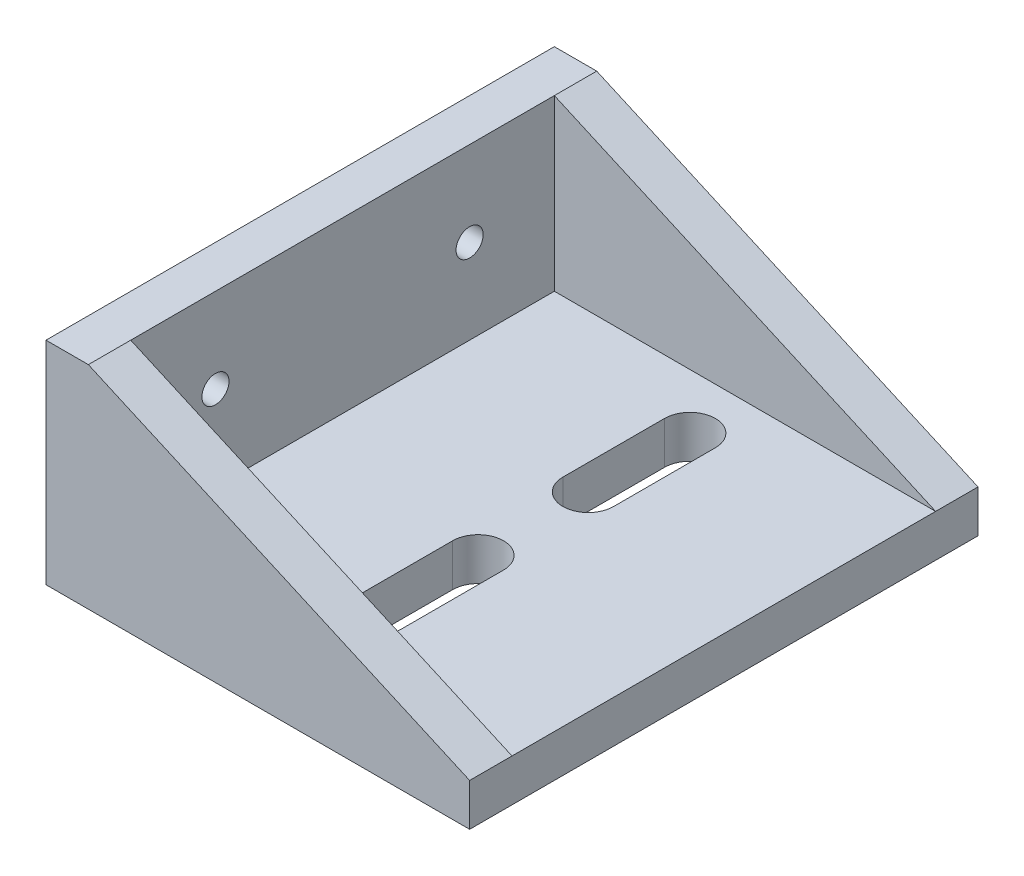
ISO-10303-21;
HEADER;
FILE_DESCRIPTION(('STEP AP214'),'2;1');
FILE_NAME('part.step','',(''),(''),'','','');
FILE_SCHEMA(('AUTOMOTIVE_DESIGN { 1 0 10303 214 1 1 1 1 }'));
ENDSEC;
DATA;
#1=APPLICATION_CONTEXT('core data for automotive mechanical design processes');
#2=APPLICATION_PROTOCOL_DEFINITION('international standard','automotive_design',2000,#1);
#3=PRODUCT_CONTEXT('',#1,'mechanical');
#4=PRODUCT('Part','Part','',(#3));
#5=PRODUCT_RELATED_PRODUCT_CATEGORY('part','',(#4));
#6=PRODUCT_DEFINITION_FORMATION('','',#4);
#7=PRODUCT_DEFINITION_CONTEXT('part definition',#1,'design');
#8=PRODUCT_DEFINITION('design','',#6,#7);
#9=PRODUCT_DEFINITION_SHAPE('','',#8);
#10=(LENGTH_UNIT() NAMED_UNIT(*) SI_UNIT(.MILLI.,.METRE.));
#11=(NAMED_UNIT(*) PLANE_ANGLE_UNIT() SI_UNIT($,.RADIAN.));
#12=(NAMED_UNIT(*) SI_UNIT($,.STERADIAN.) SOLID_ANGLE_UNIT());
#13=UNCERTAINTY_MEASURE_WITH_UNIT(LENGTH_MEASURE(1.E-05),#10,'distance_accuracy_value','');
#14=(GEOMETRIC_REPRESENTATION_CONTEXT(3) GLOBAL_UNCERTAINTY_ASSIGNED_CONTEXT((#13)) GLOBAL_UNIT_ASSIGNED_CONTEXT((#10,
#11,#12)) REPRESENTATION_CONTEXT('',''));
#15=CARTESIAN_POINT('',(0.,0.,0.));
#16=DIRECTION('',(0.,0.,1.));
#17=DIRECTION('',(1.,0.,0.));
#18=AXIS2_PLACEMENT_3D('',#15,#16,#17);
#19=CARTESIAN_POINT('',(-45.,5.,60.));
#20=DIRECTION('',(0.,-1.,0.));
#21=DIRECTION('',(0.,0.,-1.));
#22=AXIS2_PLACEMENT_3D('',#19,#20,#21);
#23=PLANE('',#22);
#24=DIRECTION('',(0.,0.,-1.));
#25=VECTOR('',#24,1.);
#26=CARTESIAN_POINT('',(-19.5,5.,23.5));
#27=LINE('',#26,#25);
#28=CARTESIAN_POINT('',(-19.5,5.,23.5));
#29=VERTEX_POINT('',#28);
#30=CARTESIAN_POINT('',(-19.5,5.,11.5));
#31=VERTEX_POINT('',#30);
#32=EDGE_CURVE('E175',#29,#31,#27,.T.);
#33=ORIENTED_EDGE('',*,*,#32,.F.);
#34=CARTESIAN_POINT('',(-22.5,5.,23.5));
#35=DIRECTION('',(0.,1.,0.));
#36=DIRECTION('',(0.,0.,1.));
#37=AXIS2_PLACEMENT_3D('',#34,#35,#36);
#38=CIRCLE('',#37,3.);
#39=CARTESIAN_POINT('',(-25.5,5.,23.5));
#40=VERTEX_POINT('',#39);
#41=EDGE_CURVE('E48',#40,#29,#38,.T.);
#42=ORIENTED_EDGE('',*,*,#41,.F.);
#43=DIRECTION('',(0.,0.,1.));
#44=VECTOR('',#43,1.);
#45=CARTESIAN_POINT('',(-25.5,5.,23.5));
#46=LINE('',#45,#44);
#47=CARTESIAN_POINT('',(-25.5,5.,11.5));
#48=VERTEX_POINT('',#47);
#49=EDGE_CURVE('E166',#48,#40,#46,.T.);
#50=ORIENTED_EDGE('',*,*,#49,.F.);
#51=CARTESIAN_POINT('',(-22.5,5.,11.5));
#52=DIRECTION('',(0.,1.,0.));
#53=DIRECTION('',(0.,0.,1.));
#54=AXIS2_PLACEMENT_3D('',#51,#52,#53);
#55=CIRCLE('',#54,3.);
#56=EDGE_CURVE('E169',#31,#48,#55,.T.);
#57=ORIENTED_EDGE('',*,*,#56,.F.);
#58=EDGE_LOOP('',(#33,#42,#50,#57));
#59=FACE_BOUND('',#58,.T.);
#60=DIRECTION('',(0.,0.,-1.));
#61=VECTOR('',#60,1.);
#62=CARTESIAN_POINT('',(-19.5,5.,48.5));
#63=LINE('',#62,#61);
#64=CARTESIAN_POINT('',(-19.5,5.,48.5));
#65=VERTEX_POINT('',#64);
#66=CARTESIAN_POINT('',(-19.5,5.,36.5));
#67=VERTEX_POINT('',#66);
#68=EDGE_CURVE('E201',#65,#67,#63,.T.);
#69=ORIENTED_EDGE('',*,*,#68,.F.);
#70=CARTESIAN_POINT('',(-22.5,5.,48.5));
#71=DIRECTION('',(0.,1.,0.));
#72=DIRECTION('',(0.,0.,-1.));
#73=AXIS2_PLACEMENT_3D('',#70,#71,#72);
#74=CIRCLE('',#73,3.);
#75=CARTESIAN_POINT('',(-25.5,5.,48.5));
#76=VERTEX_POINT('',#75);
#77=EDGE_CURVE('E56',#76,#65,#74,.T.);
#78=ORIENTED_EDGE('',*,*,#77,.F.);
#79=DIRECTION('',(0.,0.,1.));
#80=VECTOR('',#79,1.);
#81=CARTESIAN_POINT('',(-25.5,5.,48.5));
#82=LINE('',#81,#80);
#83=CARTESIAN_POINT('',(-25.5,5.,36.5));
#84=VERTEX_POINT('',#83);
#85=EDGE_CURVE('E190',#84,#76,#82,.T.);
#86=ORIENTED_EDGE('',*,*,#85,.F.);
#87=CARTESIAN_POINT('',(-22.5,5.,36.5));
#88=DIRECTION('',(0.,1.,0.));
#89=DIRECTION('',(0.,0.,-1.));
#90=AXIS2_PLACEMENT_3D('',#87,#88,#89);
#91=CIRCLE('',#90,3.);
#92=EDGE_CURVE('E204',#67,#84,#91,.T.);
#93=ORIENTED_EDGE('',*,*,#92,.F.);
#94=EDGE_LOOP('',(#69,#78,#86,#93));
#95=FACE_BOUND('',#94,.T.);
#96=DIRECTION('',(0.,0.,-1.));
#97=VECTOR('',#96,1.);
#98=CARTESIAN_POINT('',(0.,5.,60.));
#99=LINE('',#98,#97);
#100=CARTESIAN_POINT('',(0.,5.,55.));
#101=VERTEX_POINT('',#100);
#102=CARTESIAN_POINT('',(0.,5.,5.));
#103=VERTEX_POINT('',#102);
#104=EDGE_CURVE('E41',#101,#103,#99,.T.);
#105=ORIENTED_EDGE('',*,*,#104,.T.);
#106=DIRECTION('',(-1.,0.,0.));
#107=VECTOR('',#106,1.);
#108=CARTESIAN_POINT('',(0.,5.,5.));
#109=LINE('',#108,#107);
#110=CARTESIAN_POINT('',(-45.,5.,5.));
#111=VERTEX_POINT('',#110);
#112=EDGE_CURVE('E232',#103,#111,#109,.T.);
#113=ORIENTED_EDGE('',*,*,#112,.T.);
#114=DIRECTION('',(0.,0.,-1.));
#115=VECTOR('',#114,1.);
#116=CARTESIAN_POINT('',(-45.,5.,60.));
#117=LINE('',#116,#115);
#118=CARTESIAN_POINT('',(-45.,5.,55.));
#119=VERTEX_POINT('',#118);
#120=EDGE_CURVE('E282',#119,#111,#117,.T.);
#121=ORIENTED_EDGE('',*,*,#120,.F.);
#122=DIRECTION('',(1.,0.,0.));
#123=VECTOR('',#122,1.);
#124=CARTESIAN_POINT('',(0.,5.,55.));
#125=LINE('',#124,#123);
#126=EDGE_CURVE('E245',#119,#101,#125,.T.);
#127=ORIENTED_EDGE('',*,*,#126,.T.);
#128=EDGE_LOOP('',(#105,#113,#121,#127));
#129=FACE_BOUND('',#128,.T.);
#130=ADVANCED_FACE('F33',(#59,#95,#129),#23,.F.);
#131=CARTESIAN_POINT('',(-45.,25.,60.));
#132=DIRECTION('',(-1.,0.,0.));
#133=DIRECTION('',(0.,-1.,0.));
#134=AXIS2_PLACEMENT_3D('',#131,#132,#133);
#135=PLANE('',#134);
#136=CARTESIAN_POINT('',(-45.,15.,45.));
#137=DIRECTION('',(1.,0.,0.));
#138=DIRECTION('',(0.,0.,-1.));
#139=AXIS2_PLACEMENT_3D('',#136,#137,#138);
#140=CIRCLE('',#139,1.6);
#141=CARTESIAN_POINT('',(-45.,15.,43.4));
#142=VERTEX_POINT('',#141);
#143=EDGE_CURVE('E219',#142,#142,#140,.T.);
#144=ORIENTED_EDGE('',*,*,#143,.F.);
#145=EDGE_LOOP('',(#144));
#146=FACE_BOUND('',#145,.T.);
#147=CARTESIAN_POINT('',(-45.,15.,15.));
#148=DIRECTION('',(1.,0.,0.));
#149=DIRECTION('',(0.,0.,1.));
#150=AXIS2_PLACEMENT_3D('',#147,#148,#149);
#151=CIRCLE('',#150,1.6);
#152=CARTESIAN_POINT('',(-45.,15.,16.6));
#153=VERTEX_POINT('',#152);
#154=EDGE_CURVE('E182',#153,#153,#151,.T.);
#155=ORIENTED_EDGE('',*,*,#154,.F.);
#156=EDGE_LOOP('',(#155));
#157=FACE_BOUND('',#156,.T.);
#158=ORIENTED_EDGE('',*,*,#120,.T.);
#159=DIRECTION('',(0.,1.,0.));
#160=VECTOR('',#159,1.);
#161=CARTESIAN_POINT('',(-45.,5.,5.));
#162=LINE('',#161,#160);
#163=CARTESIAN_POINT('',(-45.,25.,5.));
#164=VERTEX_POINT('',#163);
#165=EDGE_CURVE('E227',#111,#164,#162,.T.);
#166=ORIENTED_EDGE('',*,*,#165,.T.);
#167=DIRECTION('',(0.,0.,-1.));
#168=VECTOR('',#167,1.);
#169=CARTESIAN_POINT('',(-45.,25.,60.));
#170=LINE('',#169,#168);
#171=CARTESIAN_POINT('',(-45.,25.,55.));
#172=VERTEX_POINT('',#171);
#173=EDGE_CURVE('E279',#172,#164,#170,.T.);
#174=ORIENTED_EDGE('',*,*,#173,.F.);
#175=DIRECTION('',(0.,-1.,0.));
#176=VECTOR('',#175,1.);
#177=CARTESIAN_POINT('',(-45.,5.,55.));
#178=LINE('',#177,#176);
#179=EDGE_CURVE('E242',#172,#119,#178,.T.);
#180=ORIENTED_EDGE('',*,*,#179,.T.);
#181=EDGE_LOOP('',(#158,#166,#174,#180));
#182=FACE_BOUND('',#181,.T.);
#183=ADVANCED_FACE('F302',(#146,#157,#182),#135,.F.);
#184=CARTESIAN_POINT('',(0.,5.,60.));
#185=DIRECTION('',(-1.,0.,0.));
#186=DIRECTION('',(0.,-1.,0.));
#187=AXIS2_PLACEMENT_3D('',#184,#185,#186);
#188=PLANE('',#187);
#189=DIRECTION('',(0.,1.,0.));
#190=VECTOR('',#189,1.);
#191=CARTESIAN_POINT('',(0.,5.,0.));
#192=LINE('',#191,#190);
#193=CARTESIAN_POINT('',(0.,0.,0.));
#194=VERTEX_POINT('',#193);
#195=CARTESIAN_POINT('',(0.,5.,0.));
#196=VERTEX_POINT('',#195);
#197=EDGE_CURVE('E251',#194,#196,#192,.T.);
#198=ORIENTED_EDGE('',*,*,#197,.T.);
#199=DIRECTION('',(0.,0.,-1.));
#200=VECTOR('',#199,1.);
#201=CARTESIAN_POINT('',(0.,5.,5.));
#202=LINE('',#201,#200);
#203=EDGE_CURVE('E237',#103,#196,#202,.T.);
#204=ORIENTED_EDGE('',*,*,#203,.F.);
#205=ORIENTED_EDGE('',*,*,#104,.F.);
#206=CARTESIAN_POINT('',(0.,5.,60.));
#207=VERTEX_POINT('',#206);
#208=EDGE_CURVE('E11',#207,#101,#99,.T.);
#209=ORIENTED_EDGE('',*,*,#208,.F.);
#210=DIRECTION('',(0.,1.,0.));
#211=VECTOR('',#210,1.);
#212=CARTESIAN_POINT('',(0.,5.,60.));
#213=LINE('',#212,#211);
#214=CARTESIAN_POINT('',(0.,0.,60.));
#215=VERTEX_POINT('',#214);
#216=EDGE_CURVE('E254',#215,#207,#213,.T.);
#217=ORIENTED_EDGE('',*,*,#216,.F.);
#218=DIRECTION('',(0.,0.,-1.));
#219=VECTOR('',#218,1.);
#220=CARTESIAN_POINT('',(0.,0.,60.));
#221=LINE('',#220,#219);
#222=EDGE_CURVE('E264',#215,#194,#221,.T.);
#223=ORIENTED_EDGE('',*,*,#222,.T.);
#224=EDGE_LOOP('',(#198,#204,#205,#209,#217,#223));
#225=FACE_BOUND('',#224,.T.);
#226=ADVANCED_FACE('F35',(#225),#188,.F.);
#227=CARTESIAN_POINT('',(-50.,25.,60.));
#228=DIRECTION('',(0.,-1.,0.));
#229=DIRECTION('',(0.,0.,-1.));
#230=AXIS2_PLACEMENT_3D('',#227,#228,#229);
#231=PLANE('',#230);
#232=DIRECTION('',(-1.,0.,0.));
#233=VECTOR('',#232,1.);
#234=CARTESIAN_POINT('',(-50.,25.,0.));
#235=LINE('',#234,#233);
#236=CARTESIAN_POINT('',(-45.,25.,0.));
#237=VERTEX_POINT('',#236);
#238=CARTESIAN_POINT('',(-50.,25.,0.));
#239=VERTEX_POINT('',#238);
#240=EDGE_CURVE('E266',#237,#239,#235,.T.);
#241=ORIENTED_EDGE('',*,*,#240,.T.);
#242=DIRECTION('',(0.,0.,-1.));
#243=VECTOR('',#242,1.);
#244=CARTESIAN_POINT('',(-50.,25.,60.));
#245=LINE('',#244,#243);
#246=CARTESIAN_POINT('',(-50.,25.,60.));
#247=VERTEX_POINT('',#246);
#248=EDGE_CURVE('E276',#247,#239,#245,.T.);
#249=ORIENTED_EDGE('',*,*,#248,.F.);
#250=DIRECTION('',(-1.,0.,0.));
#251=VECTOR('',#250,1.);
#252=CARTESIAN_POINT('',(-50.,25.,60.));
#253=LINE('',#252,#251);
#254=CARTESIAN_POINT('',(-45.,25.,60.));
#255=VERTEX_POINT('',#254);
#256=EDGE_CURVE('E257',#255,#247,#253,.T.);
#257=ORIENTED_EDGE('',*,*,#256,.F.);
#258=EDGE_CURVE('E280',#255,#172,#170,.T.);
#259=ORIENTED_EDGE('',*,*,#258,.T.);
#260=ORIENTED_EDGE('',*,*,#173,.T.);
#261=DIRECTION('',(0.,0.,-1.));
#262=VECTOR('',#261,1.);
#263=CARTESIAN_POINT('',(-45.,25.,5.));
#264=LINE('',#263,#262);
#265=EDGE_CURVE('E234',#164,#237,#264,.T.);
#266=ORIENTED_EDGE('',*,*,#265,.T.);
#267=EDGE_LOOP('',(#241,#249,#257,#259,#260,#266));
#268=FACE_BOUND('',#267,.T.);
#269=ADVANCED_FACE('F304',(#268),#231,.F.);
#270=CARTESIAN_POINT('',(-50.,0.,60.));
#271=DIRECTION('',(1.,0.,0.));
#272=DIRECTION('',(0.,1.,0.));
#273=AXIS2_PLACEMENT_3D('',#270,#271,#272);
#274=PLANE('',#273);
#275=CARTESIAN_POINT('',(-50.,15.,45.));
#276=DIRECTION('',(1.,0.,0.));
#277=DIRECTION('',(0.,0.,-1.));
#278=AXIS2_PLACEMENT_3D('',#275,#276,#277);
#279=CIRCLE('',#278,1.6);
#280=CARTESIAN_POINT('',(-50.,15.,43.4));
#281=VERTEX_POINT('',#280);
#282=EDGE_CURVE('E215',#281,#281,#279,.T.);
#283=ORIENTED_EDGE('',*,*,#282,.T.);
#284=EDGE_LOOP('',(#283));
#285=FACE_BOUND('',#284,.T.);
#286=CARTESIAN_POINT('',(-50.,15.,15.));
#287=DIRECTION('',(1.,0.,0.));
#288=DIRECTION('',(0.,0.,1.));
#289=AXIS2_PLACEMENT_3D('',#286,#287,#288);
#290=CIRCLE('',#289,1.6);
#291=CARTESIAN_POINT('',(-50.,15.,16.6));
#292=VERTEX_POINT('',#291);
#293=EDGE_CURVE('E222',#292,#292,#290,.T.);
#294=ORIENTED_EDGE('',*,*,#293,.T.);
#295=EDGE_LOOP('',(#294));
#296=FACE_BOUND('',#295,.T.);
#297=DIRECTION('',(0.,-1.,0.));
#298=VECTOR('',#297,1.);
#299=CARTESIAN_POINT('',(-50.,0.,0.));
#300=LINE('',#299,#298);
#301=CARTESIAN_POINT('',(-50.,0.,0.));
#302=VERTEX_POINT('',#301);
#303=EDGE_CURVE('E268',#239,#302,#300,.T.);
#304=ORIENTED_EDGE('',*,*,#303,.T.);
#305=DIRECTION('',(0.,0.,-1.));
#306=VECTOR('',#305,1.);
#307=CARTESIAN_POINT('',(-50.,0.,60.));
#308=LINE('',#307,#306);
#309=CARTESIAN_POINT('',(-50.,0.,60.));
#310=VERTEX_POINT('',#309);
#311=EDGE_CURVE('E273',#310,#302,#308,.T.);
#312=ORIENTED_EDGE('',*,*,#311,.F.);
#313=DIRECTION('',(0.,-1.,0.));
#314=VECTOR('',#313,1.);
#315=CARTESIAN_POINT('',(-50.,0.,60.));
#316=LINE('',#315,#314);
#317=EDGE_CURVE('E260',#247,#310,#316,.T.);
#318=ORIENTED_EDGE('',*,*,#317,.F.);
#319=ORIENTED_EDGE('',*,*,#248,.T.);
#320=EDGE_LOOP('',(#304,#312,#318,#319));
#321=FACE_BOUND('',#320,.T.);
#322=ADVANCED_FACE('F338',(#285,#296,#321),#274,.F.);
#323=CARTESIAN_POINT('',(0.,0.,60.));
#324=DIRECTION('',(0.,1.,0.));
#325=DIRECTION('',(-1.,0.,0.));
#326=AXIS2_PLACEMENT_3D('',#323,#324,#325);
#327=PLANE('',#326);
#328=DIRECTION('',(0.,0.,1.));
#329=VECTOR('',#328,1.);
#330=CARTESIAN_POINT('',(-25.5,0.,23.5));
#331=LINE('',#330,#329);
#332=CARTESIAN_POINT('',(-25.5,0.,11.5));
#333=VERTEX_POINT('',#332);
#334=CARTESIAN_POINT('',(-25.5,0.,23.5));
#335=VERTEX_POINT('',#334);
#336=EDGE_CURVE('E153',#333,#335,#331,.T.);
#337=ORIENTED_EDGE('',*,*,#336,.T.);
#338=CARTESIAN_POINT('',(-22.5,0.,23.5));
#339=DIRECTION('',(0.,1.,0.));
#340=DIRECTION('',(0.,0.,1.));
#341=AXIS2_PLACEMENT_3D('',#338,#339,#340);
#342=CIRCLE('',#341,3.);
#343=CARTESIAN_POINT('',(-19.5,0.,23.5));
#344=VERTEX_POINT('',#343);
#345=EDGE_CURVE('E147',#335,#344,#342,.T.);
#346=ORIENTED_EDGE('',*,*,#345,.T.);
#347=DIRECTION('',(0.,0.,-1.));
#348=VECTOR('',#347,1.);
#349=CARTESIAN_POINT('',(-19.5,0.,23.5));
#350=LINE('',#349,#348);
#351=CARTESIAN_POINT('',(-19.5,0.,11.5));
#352=VERTEX_POINT('',#351);
#353=EDGE_CURVE('E157',#344,#352,#350,.T.);
#354=ORIENTED_EDGE('',*,*,#353,.T.);
#355=CARTESIAN_POINT('',(-22.5,0.,11.5));
#356=DIRECTION('',(0.,1.,0.));
#357=DIRECTION('',(0.,0.,1.));
#358=AXIS2_PLACEMENT_3D('',#355,#356,#357);
#359=CIRCLE('',#358,3.);
#360=EDGE_CURVE('E161',#352,#333,#359,.T.);
#361=ORIENTED_EDGE('',*,*,#360,.T.);
#362=EDGE_LOOP('',(#337,#346,#354,#361));
#363=FACE_BOUND('',#362,.T.);
#364=DIRECTION('',(0.,0.,1.));
#365=VECTOR('',#364,1.);
#366=CARTESIAN_POINT('',(-25.5,0.,48.5));
#367=LINE('',#366,#365);
#368=CARTESIAN_POINT('',(-25.5,0.,36.5));
#369=VERTEX_POINT('',#368);
#370=CARTESIAN_POINT('',(-25.5,0.,48.5));
#371=VERTEX_POINT('',#370);
#372=EDGE_CURVE('E196',#369,#371,#367,.T.);
#373=ORIENTED_EDGE('',*,*,#372,.T.);
#374=CARTESIAN_POINT('',(-22.5,0.,48.5));
#375=DIRECTION('',(0.,1.,0.));
#376=DIRECTION('',(0.,0.,-1.));
#377=AXIS2_PLACEMENT_3D('',#374,#375,#376);
#378=CIRCLE('',#377,3.);
#379=CARTESIAN_POINT('',(-19.5,0.,48.5));
#380=VERTEX_POINT('',#379);
#381=EDGE_CURVE('E186',#371,#380,#378,.T.);
#382=ORIENTED_EDGE('',*,*,#381,.T.);
#383=DIRECTION('',(0.,0.,-1.));
#384=VECTOR('',#383,1.);
#385=CARTESIAN_POINT('',(-19.5,0.,48.5));
#386=LINE('',#385,#384);
#387=CARTESIAN_POINT('',(-19.5,0.,36.5));
#388=VERTEX_POINT('',#387);
#389=EDGE_CURVE('E189',#380,#388,#386,.T.);
#390=ORIENTED_EDGE('',*,*,#389,.T.);
#391=CARTESIAN_POINT('',(-22.5,0.,36.5));
#392=DIRECTION('',(0.,1.,0.));
#393=DIRECTION('',(0.,0.,-1.));
#394=AXIS2_PLACEMENT_3D('',#391,#392,#393);
#395=CIRCLE('',#394,3.);
#396=EDGE_CURVE('E193',#388,#369,#395,.T.);
#397=ORIENTED_EDGE('',*,*,#396,.T.);
#398=EDGE_LOOP('',(#373,#382,#390,#397));
#399=FACE_BOUND('',#398,.T.);
#400=DIRECTION('',(1.,0.,0.));
#401=VECTOR('',#400,1.);
#402=CARTESIAN_POINT('',(0.,0.,0.));
#403=LINE('',#402,#401);
#404=EDGE_CURVE('E258',#302,#194,#403,.T.);
#405=ORIENTED_EDGE('',*,*,#404,.T.);
#406=ORIENTED_EDGE('',*,*,#222,.F.);
#407=DIRECTION('',(1.,0.,0.));
#408=VECTOR('',#407,1.);
#409=CARTESIAN_POINT('',(0.,0.,60.));
#410=LINE('',#409,#408);
#411=EDGE_CURVE('E262',#310,#215,#410,.T.);
#412=ORIENTED_EDGE('',*,*,#411,.F.);
#413=ORIENTED_EDGE('',*,*,#311,.T.);
#414=EDGE_LOOP('',(#405,#406,#412,#413));
#415=FACE_BOUND('',#414,.T.);
#416=ADVANCED_FACE('F163',(#363,#399,#415),#327,.F.);
#417=CARTESIAN_POINT('',(0.,0.,60.));
#418=DIRECTION('',(0.,0.,-1.));
#419=DIRECTION('',(-1.,0.,0.));
#420=AXIS2_PLACEMENT_3D('',#417,#418,#419);
#421=PLANE('',#420);
#422=DIRECTION('',(-0.913811548620257,0.406138466053447,0.));
#423=VECTOR('',#422,1.);
#424=CARTESIAN_POINT('',(-45.,25.,60.));
#425=LINE('',#424,#423);
#426=EDGE_CURVE('E240',#207,#255,#425,.T.);
#427=ORIENTED_EDGE('',*,*,#426,.T.);
#428=ORIENTED_EDGE('',*,*,#256,.T.);
#429=ORIENTED_EDGE('',*,*,#317,.T.);
#430=ORIENTED_EDGE('',*,*,#411,.T.);
#431=ORIENTED_EDGE('',*,*,#216,.T.);
#432=EDGE_LOOP('',(#427,#428,#429,#430,#431));
#433=FACE_BOUND('',#432,.T.);
#434=ADVANCED_FACE('F312',(#433),#421,.F.);
#435=CARTESIAN_POINT('',(0.,0.,0.));
#436=DIRECTION('',(0.,0.,-1.));
#437=DIRECTION('',(-1.,0.,0.));
#438=AXIS2_PLACEMENT_3D('',#435,#436,#437);
#439=PLANE('',#438);
#440=ORIENTED_EDGE('',*,*,#240,.F.);
#441=DIRECTION('',(0.913811548620257,-0.406138466053447,0.));
#442=VECTOR('',#441,1.);
#443=CARTESIAN_POINT('',(-45.,25.,0.));
#444=LINE('',#443,#442);
#445=EDGE_CURVE('E218',#237,#196,#444,.T.);
#446=ORIENTED_EDGE('',*,*,#445,.T.);
#447=ORIENTED_EDGE('',*,*,#197,.F.);
#448=ORIENTED_EDGE('',*,*,#404,.F.);
#449=ORIENTED_EDGE('',*,*,#303,.F.);
#450=EDGE_LOOP('',(#440,#446,#447,#448,#449));
#451=FACE_BOUND('',#450,.T.);
#452=ADVANCED_FACE('F325',(#451),#439,.T.);
#453=CARTESIAN_POINT('',(-45.,25.,55.));
#454=DIRECTION('',(0.406138466053447,0.913811548620257,0.));
#455=DIRECTION('',(-0.913811548620257,0.406138466053447,0.));
#456=AXIS2_PLACEMENT_3D('',#453,#454,#455);
#457=PLANE('',#456);
#458=ORIENTED_EDGE('',*,*,#426,.F.);
#459=ORIENTED_EDGE('',*,*,#208,.T.);
#460=DIRECTION('',(-0.913811548620257,0.406138466053447,0.));
#461=VECTOR('',#460,1.);
#462=CARTESIAN_POINT('',(-45.,25.,55.));
#463=LINE('',#462,#461);
#464=EDGE_CURVE('E248',#101,#172,#463,.T.);
#465=ORIENTED_EDGE('',*,*,#464,.T.);
#466=ORIENTED_EDGE('',*,*,#258,.F.);
#467=EDGE_LOOP('',(#458,#459,#465,#466));
#468=FACE_BOUND('',#467,.T.);
#469=ADVANCED_FACE('F309',(#468),#457,.T.);
#470=CARTESIAN_POINT('',(0.,0.,55.));
#471=DIRECTION('',(0.,0.,1.));
#472=DIRECTION('',(1.,0.,0.));
#473=AXIS2_PLACEMENT_3D('',#470,#471,#472);
#474=PLANE('',#473);
#475=ORIENTED_EDGE('',*,*,#179,.F.);
#476=ORIENTED_EDGE('',*,*,#464,.F.);
#477=ORIENTED_EDGE('',*,*,#126,.F.);
#478=EDGE_LOOP('',(#475,#476,#477));
#479=FACE_BOUND('',#478,.T.);
#480=ADVANCED_FACE('F317',(#479),#474,.F.);
#481=CARTESIAN_POINT('',(-45.,25.,5.));
#482=DIRECTION('',(0.406138466053447,0.913811548620257,0.));
#483=DIRECTION('',(-0.913811548620257,0.406138466053447,0.));
#484=AXIS2_PLACEMENT_3D('',#481,#482,#483);
#485=PLANE('',#484);
#486=ORIENTED_EDGE('',*,*,#445,.F.);
#487=ORIENTED_EDGE('',*,*,#265,.F.);
#488=DIRECTION('',(0.913811548620257,-0.406138466053447,0.));
#489=VECTOR('',#488,1.);
#490=CARTESIAN_POINT('',(-45.,25.,5.));
#491=LINE('',#490,#489);
#492=EDGE_CURVE('E229',#164,#103,#491,.T.);
#493=ORIENTED_EDGE('',*,*,#492,.T.);
#494=ORIENTED_EDGE('',*,*,#203,.T.);
#495=EDGE_LOOP('',(#486,#487,#493,#494));
#496=FACE_BOUND('',#495,.T.);
#497=ADVANCED_FACE('F297',(#496),#485,.T.);
#498=CARTESIAN_POINT('',(0.,0.,5.));
#499=DIRECTION('',(0.,0.,1.));
#500=DIRECTION('',(1.,0.,0.));
#501=AXIS2_PLACEMENT_3D('',#498,#499,#500);
#502=PLANE('',#501);
#503=ORIENTED_EDGE('',*,*,#165,.F.);
#504=ORIENTED_EDGE('',*,*,#112,.F.);
#505=ORIENTED_EDGE('',*,*,#492,.F.);
#506=EDGE_LOOP('',(#503,#504,#505));
#507=FACE_BOUND('',#506,.T.);
#508=ADVANCED_FACE('F299',(#507),#502,.T.);
#509=CARTESIAN_POINT('',(-50.,15.,15.));
#510=DIRECTION('',(1.,0.,0.));
#511=DIRECTION('',(0.,0.,-1.));
#512=AXIS2_PLACEMENT_3D('',#509,#510,#511);
#513=CYLINDRICAL_SURFACE('',#512,1.6);
#514=ORIENTED_EDGE('',*,*,#293,.F.);
#515=EDGE_LOOP('',(#514));
#516=FACE_BOUND('',#515,.T.);
#517=ORIENTED_EDGE('',*,*,#154,.T.);
#518=EDGE_LOOP('',(#517));
#519=FACE_BOUND('',#518,.T.);
#520=ADVANCED_FACE('F394',(#516,#519),#513,.F.);
#521=CARTESIAN_POINT('',(-50.,15.,45.));
#522=DIRECTION('',(1.,0.,0.));
#523=DIRECTION('',(0.,0.,-1.));
#524=AXIS2_PLACEMENT_3D('',#521,#522,#523);
#525=CYLINDRICAL_SURFACE('',#524,1.6);
#526=ORIENTED_EDGE('',*,*,#282,.F.);
#527=EDGE_LOOP('',(#526));
#528=FACE_BOUND('',#527,.T.);
#529=ORIENTED_EDGE('',*,*,#143,.T.);
#530=EDGE_LOOP('',(#529));
#531=FACE_BOUND('',#530,.T.);
#532=ADVANCED_FACE('F399',(#528,#531),#525,.F.);
#533=CARTESIAN_POINT('',(-22.5,0.,48.5));
#534=DIRECTION('',(0.,1.,0.));
#535=DIRECTION('',(0.,0.,1.));
#536=AXIS2_PLACEMENT_3D('',#533,#534,#535);
#537=CYLINDRICAL_SURFACE('',#536,3.);
#538=ORIENTED_EDGE('',*,*,#77,.T.);
#539=DIRECTION('',(0.,1.,0.));
#540=VECTOR('',#539,1.);
#541=CARTESIAN_POINT('',(-19.5,0.,48.5));
#542=LINE('',#541,#540);
#543=EDGE_CURVE('E199',#380,#65,#542,.T.);
#544=ORIENTED_EDGE('',*,*,#543,.F.);
#545=ORIENTED_EDGE('',*,*,#381,.F.);
#546=DIRECTION('',(0.,1.,0.));
#547=VECTOR('',#546,1.);
#548=CARTESIAN_POINT('',(-25.5,0.,48.5));
#549=LINE('',#548,#547);
#550=EDGE_CURVE('E176',#371,#76,#549,.T.);
#551=ORIENTED_EDGE('',*,*,#550,.T.);
#552=EDGE_LOOP('',(#538,#544,#545,#551));
#553=FACE_BOUND('',#552,.T.);
#554=ADVANCED_FACE('F410',(#553),#537,.F.);
#555=CARTESIAN_POINT('',(-25.5,0.,48.5));
#556=DIRECTION('',(-1.,0.,0.));
#557=DIRECTION('',(0.,0.,1.));
#558=AXIS2_PLACEMENT_3D('',#555,#556,#557);
#559=PLANE('',#558);
#560=ORIENTED_EDGE('',*,*,#85,.T.);
#561=ORIENTED_EDGE('',*,*,#550,.F.);
#562=ORIENTED_EDGE('',*,*,#372,.F.);
#563=DIRECTION('',(0.,1.,0.));
#564=VECTOR('',#563,1.);
#565=CARTESIAN_POINT('',(-25.5,0.,36.5));
#566=LINE('',#565,#564);
#567=EDGE_CURVE('E210',#369,#84,#566,.T.);
#568=ORIENTED_EDGE('',*,*,#567,.T.);
#569=EDGE_LOOP('',(#560,#561,#562,#568));
#570=FACE_BOUND('',#569,.T.);
#571=ADVANCED_FACE('F429',(#570),#559,.F.);
#572=CARTESIAN_POINT('',(-22.5,0.,36.5));
#573=DIRECTION('',(0.,1.,0.));
#574=DIRECTION('',(0.,0.,1.));
#575=AXIS2_PLACEMENT_3D('',#572,#573,#574);
#576=CYLINDRICAL_SURFACE('',#575,3.);
#577=ORIENTED_EDGE('',*,*,#92,.T.);
#578=ORIENTED_EDGE('',*,*,#567,.F.);
#579=ORIENTED_EDGE('',*,*,#396,.F.);
#580=DIRECTION('',(0.,1.,0.));
#581=VECTOR('',#580,1.);
#582=CARTESIAN_POINT('',(-19.5,0.,36.5));
#583=LINE('',#582,#581);
#584=EDGE_CURVE('E212',#388,#67,#583,.T.);
#585=ORIENTED_EDGE('',*,*,#584,.T.);
#586=EDGE_LOOP('',(#577,#578,#579,#585));
#587=FACE_BOUND('',#586,.T.);
#588=ADVANCED_FACE('F438',(#587),#576,.F.);
#589=CARTESIAN_POINT('',(-19.5,0.,48.5));
#590=DIRECTION('',(1.,0.,0.));
#591=DIRECTION('',(0.,0.,-1.));
#592=AXIS2_PLACEMENT_3D('',#589,#590,#591);
#593=PLANE('',#592);
#594=ORIENTED_EDGE('',*,*,#68,.T.);
#595=ORIENTED_EDGE('',*,*,#584,.F.);
#596=ORIENTED_EDGE('',*,*,#389,.F.);
#597=ORIENTED_EDGE('',*,*,#543,.T.);
#598=EDGE_LOOP('',(#594,#595,#596,#597));
#599=FACE_BOUND('',#598,.T.);
#600=ADVANCED_FACE('F448',(#599),#593,.F.);
#601=CARTESIAN_POINT('',(-22.5,0.,23.5));
#602=DIRECTION('',(0.,1.,0.));
#603=DIRECTION('',(0.,0.,1.));
#604=AXIS2_PLACEMENT_3D('',#601,#602,#603);
#605=CYLINDRICAL_SURFACE('',#604,3.);
#606=ORIENTED_EDGE('',*,*,#41,.T.);
#607=DIRECTION('',(0.,1.,0.));
#608=VECTOR('',#607,1.);
#609=CARTESIAN_POINT('',(-19.5,0.,23.5));
#610=LINE('',#609,#608);
#611=EDGE_CURVE('E143',#344,#29,#610,.T.);
#612=ORIENTED_EDGE('',*,*,#611,.F.);
#613=ORIENTED_EDGE('',*,*,#345,.F.);
#614=DIRECTION('',(0.,1.,0.));
#615=VECTOR('',#614,1.);
#616=CARTESIAN_POINT('',(-25.5,0.,23.5));
#617=LINE('',#616,#615);
#618=EDGE_CURVE('E180',#335,#40,#617,.T.);
#619=ORIENTED_EDGE('',*,*,#618,.T.);
#620=EDGE_LOOP('',(#606,#612,#613,#619));
#621=FACE_BOUND('',#620,.T.);
#622=ADVANCED_FACE('F145',(#621),#605,.F.);
#623=CARTESIAN_POINT('',(-25.5,0.,23.5));
#624=DIRECTION('',(-1.,0.,0.));
#625=DIRECTION('',(0.,0.,1.));
#626=AXIS2_PLACEMENT_3D('',#623,#624,#625);
#627=PLANE('',#626);
#628=ORIENTED_EDGE('',*,*,#49,.T.);
#629=ORIENTED_EDGE('',*,*,#618,.F.);
#630=ORIENTED_EDGE('',*,*,#336,.F.);
#631=DIRECTION('',(0.,1.,0.));
#632=VECTOR('',#631,1.);
#633=CARTESIAN_POINT('',(-25.5,0.,11.5));
#634=LINE('',#633,#632);
#635=EDGE_CURVE('E183',#333,#48,#634,.T.);
#636=ORIENTED_EDGE('',*,*,#635,.T.);
#637=EDGE_LOOP('',(#628,#629,#630,#636));
#638=FACE_BOUND('',#637,.T.);
#639=ADVANCED_FACE('F467',(#638),#627,.F.);
#640=CARTESIAN_POINT('',(-22.5,0.,11.5));
#641=DIRECTION('',(0.,1.,0.));
#642=DIRECTION('',(0.,0.,1.));
#643=AXIS2_PLACEMENT_3D('',#640,#641,#642);
#644=CYLINDRICAL_SURFACE('',#643,3.);
#645=ORIENTED_EDGE('',*,*,#56,.T.);
#646=ORIENTED_EDGE('',*,*,#635,.F.);
#647=ORIENTED_EDGE('',*,*,#360,.F.);
#648=DIRECTION('',(0.,1.,0.));
#649=VECTOR('',#648,1.);
#650=CARTESIAN_POINT('',(-19.5,0.,11.5));
#651=LINE('',#650,#649);
#652=EDGE_CURVE('E152',#352,#31,#651,.T.);
#653=ORIENTED_EDGE('',*,*,#652,.T.);
#654=EDGE_LOOP('',(#645,#646,#647,#653));
#655=FACE_BOUND('',#654,.T.);
#656=ADVANCED_FACE('F476',(#655),#644,.F.);
#657=CARTESIAN_POINT('',(-19.5,0.,23.5));
#658=DIRECTION('',(1.,0.,0.));
#659=DIRECTION('',(0.,0.,-1.));
#660=AXIS2_PLACEMENT_3D('',#657,#658,#659);
#661=PLANE('',#660);
#662=ORIENTED_EDGE('',*,*,#32,.T.);
#663=ORIENTED_EDGE('',*,*,#652,.F.);
#664=ORIENTED_EDGE('',*,*,#353,.F.);
#665=ORIENTED_EDGE('',*,*,#611,.T.);
#666=EDGE_LOOP('',(#662,#663,#664,#665));
#667=FACE_BOUND('',#666,.T.);
#668=ADVANCED_FACE('F158',(#667),#661,.F.);
#669=CLOSED_SHELL('',(#130,#183,#226,#269,#322,#416,#434,#452,#469,#480,#497,#508,#520,#532,
#554,#571,#588,#600,#622,#639,#656,#668));
#670=MANIFOLD_SOLID_BREP('B2',#669);
#671=ADVANCED_BREP_SHAPE_REPRESENTATION('',(#18,#670),#14);
#672=SHAPE_DEFINITION_REPRESENTATION(#9,#671);
ENDSEC;
END-ISO-10303-21;
